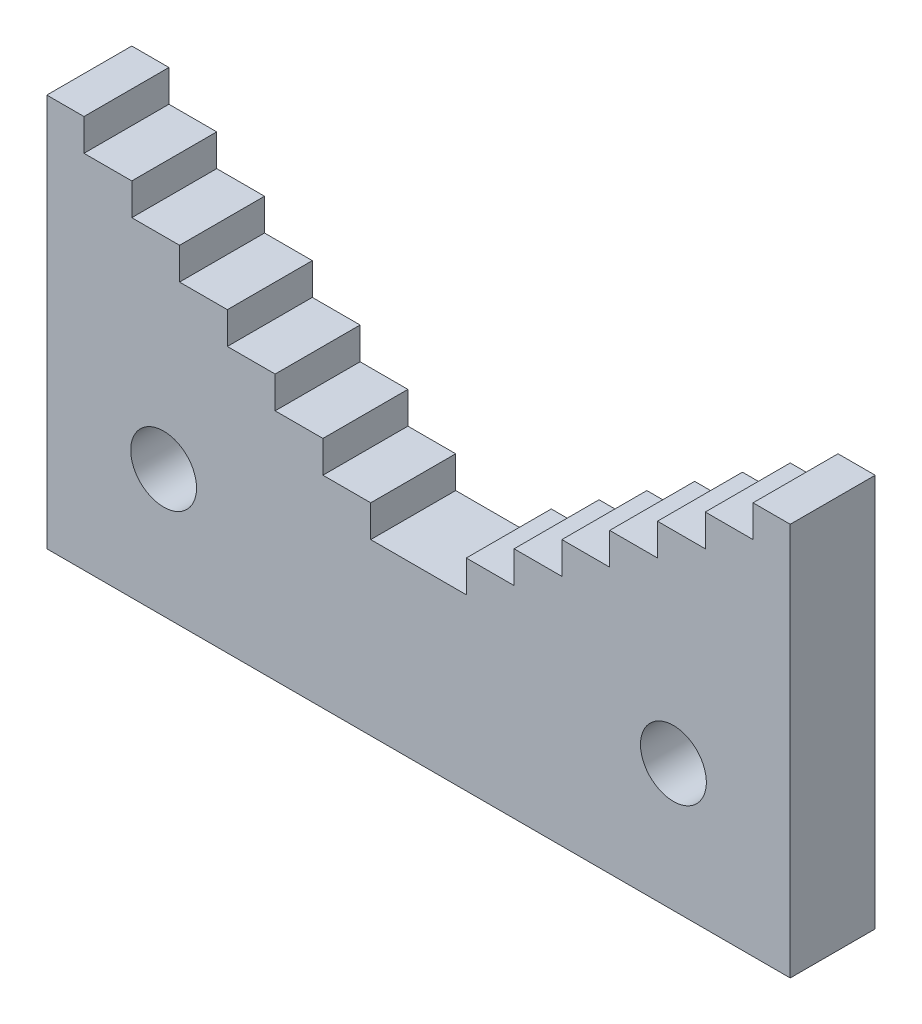
ISO-10303-21;
HEADER;
FILE_DESCRIPTION(('STEP AP214'),'2;1');
FILE_NAME('part.step','',(''),(''),'','','');
FILE_SCHEMA(('AUTOMOTIVE_DESIGN { 1 0 10303 214 1 1 1 1 }'));
ENDSEC;
DATA;
#1=APPLICATION_CONTEXT('core data for automotive mechanical design processes');
#2=APPLICATION_PROTOCOL_DEFINITION('international standard','automotive_design',2000,#1);
#3=PRODUCT_CONTEXT('',#1,'mechanical');
#4=PRODUCT('Part','Part','',(#3));
#5=PRODUCT_RELATED_PRODUCT_CATEGORY('part','',(#4));
#6=PRODUCT_DEFINITION_FORMATION('','',#4);
#7=PRODUCT_DEFINITION_CONTEXT('part definition',#1,'design');
#8=PRODUCT_DEFINITION('design','',#6,#7);
#9=PRODUCT_DEFINITION_SHAPE('','',#8);
#10=(LENGTH_UNIT() NAMED_UNIT(*) SI_UNIT(.MILLI.,.METRE.));
#11=(NAMED_UNIT(*) PLANE_ANGLE_UNIT() SI_UNIT($,.RADIAN.));
#12=(NAMED_UNIT(*) SI_UNIT($,.STERADIAN.) SOLID_ANGLE_UNIT());
#13=UNCERTAINTY_MEASURE_WITH_UNIT(LENGTH_MEASURE(1.E-05),#10,'distance_accuracy_value','');
#14=(GEOMETRIC_REPRESENTATION_CONTEXT(3) GLOBAL_UNCERTAINTY_ASSIGNED_CONTEXT((#13)) GLOBAL_UNIT_ASSIGNED_CONTEXT((#10,
#11,#12)) REPRESENTATION_CONTEXT('',''));
#15=CARTESIAN_POINT('',(0.,0.,0.));
#16=DIRECTION('',(0.,0.,1.));
#17=DIRECTION('',(1.,0.,0.));
#18=AXIS2_PLACEMENT_3D('',#15,#16,#17);
#19=CARTESIAN_POINT('',(0.,0.,8.));
#20=DIRECTION('',(0.,0.,-1.));
#21=DIRECTION('',(-1.,0.,0.));
#22=AXIS2_PLACEMENT_3D('',#19,#20,#21);
#23=PLANE('',#22);
#24=DIRECTION('',(-1.,0.,0.));
#25=VECTOR('',#24,1.);
#26=CARTESIAN_POINT('',(-35.,37.,8.));
#27=LINE('',#26,#25);
#28=CARTESIAN_POINT('',(-31.5,37.,8.));
#29=VERTEX_POINT('',#28);
#30=CARTESIAN_POINT('',(-35.,37.,8.));
#31=VERTEX_POINT('',#30);
#32=EDGE_CURVE('E247',#29,#31,#27,.T.);
#33=ORIENTED_EDGE('',*,*,#32,.T.);
#34=DIRECTION('',(0.,-1.,0.));
#35=VECTOR('',#34,1.);
#36=CARTESIAN_POINT('',(-35.,0.,8.));
#37=LINE('',#36,#35);
#38=CARTESIAN_POINT('',(-35.,0.,8.));
#39=VERTEX_POINT('',#38);
#40=EDGE_CURVE('E128',#31,#39,#37,.T.);
#41=ORIENTED_EDGE('',*,*,#40,.T.);
#42=DIRECTION('',(1.,0.,0.));
#43=VECTOR('',#42,1.);
#44=CARTESIAN_POINT('',(0.,0.,8.));
#45=LINE('',#44,#43);
#46=CARTESIAN_POINT('',(35.,0.,8.));
#47=VERTEX_POINT('',#46);
#48=EDGE_CURVE('E303',#39,#47,#45,.T.);
#49=ORIENTED_EDGE('',*,*,#48,.T.);
#50=DIRECTION('',(0.,-1.,0.));
#51=VECTOR('',#50,1.);
#52=CARTESIAN_POINT('',(35.,0.,8.));
#53=LINE('',#52,#51);
#54=CARTESIAN_POINT('',(35.,37.,8.));
#55=VERTEX_POINT('',#54);
#56=EDGE_CURVE('E337',#55,#47,#53,.T.);
#57=ORIENTED_EDGE('',*,*,#56,.F.);
#58=DIRECTION('',(1.,0.,0.));
#59=VECTOR('',#58,1.);
#60=CARTESIAN_POINT('',(35.,37.,8.));
#61=LINE('',#60,#59);
#62=CARTESIAN_POINT('',(31.5,37.,8.));
#63=VERTEX_POINT('',#62);
#64=EDGE_CURVE('E319',#63,#55,#61,.T.);
#65=ORIENTED_EDGE('',*,*,#64,.F.);
#66=DIRECTION('',(0.,1.,0.));
#67=VECTOR('',#66,1.);
#68=CARTESIAN_POINT('',(31.5,37.,8.));
#69=LINE('',#68,#67);
#70=CARTESIAN_POINT('',(31.5,34.,8.));
#71=VERTEX_POINT('',#70);
#72=EDGE_CURVE('E325',#71,#63,#69,.T.);
#73=ORIENTED_EDGE('',*,*,#72,.F.);
#74=DIRECTION('',(1.,0.,0.));
#75=VECTOR('',#74,1.);
#76=CARTESIAN_POINT('',(31.5,34.,8.));
#77=LINE('',#76,#75);
#78=CARTESIAN_POINT('',(27.,34.,8.));
#79=VERTEX_POINT('',#78);
#80=EDGE_CURVE('E486',#79,#71,#77,.T.);
#81=ORIENTED_EDGE('',*,*,#80,.F.);
#82=DIRECTION('',(0.,1.,0.));
#83=VECTOR('',#82,1.);
#84=CARTESIAN_POINT('',(27.,34.,8.));
#85=LINE('',#84,#83);
#86=CARTESIAN_POINT('',(27.,31.,8.));
#87=VERTEX_POINT('',#86);
#88=EDGE_CURVE('E482',#87,#79,#85,.T.);
#89=ORIENTED_EDGE('',*,*,#88,.F.);
#90=DIRECTION('',(1.,0.,0.));
#91=VECTOR('',#90,1.);
#92=CARTESIAN_POINT('',(27.,31.,8.));
#93=LINE('',#92,#91);
#94=CARTESIAN_POINT('',(22.5,31.,8.));
#95=VERTEX_POINT('',#94);
#96=EDGE_CURVE('E478',#95,#87,#93,.T.);
#97=ORIENTED_EDGE('',*,*,#96,.F.);
#98=DIRECTION('',(0.,1.,0.));
#99=VECTOR('',#98,1.);
#100=CARTESIAN_POINT('',(22.5,31.,8.));
#101=LINE('',#100,#99);
#102=CARTESIAN_POINT('',(22.5,28.,8.));
#103=VERTEX_POINT('',#102);
#104=EDGE_CURVE('E474',#103,#95,#101,.T.);
#105=ORIENTED_EDGE('',*,*,#104,.F.);
#106=DIRECTION('',(1.,0.,0.));
#107=VECTOR('',#106,1.);
#108=CARTESIAN_POINT('',(22.5,28.,8.));
#109=LINE('',#108,#107);
#110=CARTESIAN_POINT('',(18.,28.,8.));
#111=VERTEX_POINT('',#110);
#112=EDGE_CURVE('E470',#111,#103,#109,.T.);
#113=ORIENTED_EDGE('',*,*,#112,.F.);
#114=DIRECTION('',(0.,1.,0.));
#115=VECTOR('',#114,1.);
#116=CARTESIAN_POINT('',(18.,28.,8.));
#117=LINE('',#116,#115);
#118=CARTESIAN_POINT('',(18.,25.,8.));
#119=VERTEX_POINT('',#118);
#120=EDGE_CURVE('E466',#119,#111,#117,.T.);
#121=ORIENTED_EDGE('',*,*,#120,.F.);
#122=DIRECTION('',(1.,0.,0.));
#123=VECTOR('',#122,1.);
#124=CARTESIAN_POINT('',(18.,25.,8.));
#125=LINE('',#124,#123);
#126=CARTESIAN_POINT('',(13.5,25.,8.));
#127=VERTEX_POINT('',#126);
#128=EDGE_CURVE('E462',#127,#119,#125,.T.);
#129=ORIENTED_EDGE('',*,*,#128,.F.);
#130=DIRECTION('',(0.,1.,0.));
#131=VECTOR('',#130,1.);
#132=CARTESIAN_POINT('',(13.5,25.,8.));
#133=LINE('',#132,#131);
#134=CARTESIAN_POINT('',(13.5,22.,8.));
#135=VERTEX_POINT('',#134);
#136=EDGE_CURVE('E458',#135,#127,#133,.T.);
#137=ORIENTED_EDGE('',*,*,#136,.F.);
#138=DIRECTION('',(1.,0.,0.));
#139=VECTOR('',#138,1.);
#140=CARTESIAN_POINT('',(13.5,22.,8.));
#141=LINE('',#140,#139);
#142=CARTESIAN_POINT('',(9.00000000000001,22.,8.));
#143=VERTEX_POINT('',#142);
#144=EDGE_CURVE('E454',#143,#135,#141,.T.);
#145=ORIENTED_EDGE('',*,*,#144,.F.);
#146=DIRECTION('',(0.,1.,0.));
#147=VECTOR('',#146,1.);
#148=CARTESIAN_POINT('',(9.00000000000001,22.,8.));
#149=LINE('',#148,#147);
#150=CARTESIAN_POINT('',(9.00000000000001,19.,8.));
#151=VERTEX_POINT('',#150);
#152=EDGE_CURVE('E450',#151,#143,#149,.T.);
#153=ORIENTED_EDGE('',*,*,#152,.F.);
#154=DIRECTION('',(1.,0.,0.));
#155=VECTOR('',#154,1.);
#156=CARTESIAN_POINT('',(9.00000000000001,19.,8.));
#157=LINE('',#156,#155);
#158=CARTESIAN_POINT('',(4.5,19.,8.));
#159=VERTEX_POINT('',#158);
#160=EDGE_CURVE('E446',#159,#151,#157,.T.);
#161=ORIENTED_EDGE('',*,*,#160,.F.);
#162=DIRECTION('',(0.,1.,0.));
#163=VECTOR('',#162,1.);
#164=CARTESIAN_POINT('',(4.5,19.,8.));
#165=LINE('',#164,#163);
#166=CARTESIAN_POINT('',(4.5,16.,8.));
#167=VERTEX_POINT('',#166);
#168=EDGE_CURVE('E442',#167,#159,#165,.T.);
#169=ORIENTED_EDGE('',*,*,#168,.F.);
#170=DIRECTION('',(-1.,0.,0.));
#171=VECTOR('',#170,1.);
#172=CARTESIAN_POINT('',(-4.5,16.,8.));
#173=LINE('',#172,#171);
#174=CARTESIAN_POINT('',(-4.5,16.,8.));
#175=VERTEX_POINT('',#174);
#176=EDGE_CURVE('E409',#167,#175,#173,.T.);
#177=ORIENTED_EDGE('',*,*,#176,.T.);
#178=DIRECTION('',(0.,1.,0.));
#179=VECTOR('',#178,1.);
#180=CARTESIAN_POINT('',(-4.5,19.,8.));
#181=LINE('',#180,#179);
#182=CARTESIAN_POINT('',(-4.5,19.,8.));
#183=VERTEX_POINT('',#182);
#184=EDGE_CURVE('E412',#175,#183,#181,.T.);
#185=ORIENTED_EDGE('',*,*,#184,.T.);
#186=DIRECTION('',(-1.,0.,0.));
#187=VECTOR('',#186,1.);
#188=CARTESIAN_POINT('',(-9.00000000000001,19.,8.));
#189=LINE('',#188,#187);
#190=CARTESIAN_POINT('',(-9.00000000000001,19.,8.));
#191=VERTEX_POINT('',#190);
#192=EDGE_CURVE('E415',#183,#191,#189,.T.);
#193=ORIENTED_EDGE('',*,*,#192,.T.);
#194=DIRECTION('',(0.,1.,0.));
#195=VECTOR('',#194,1.);
#196=CARTESIAN_POINT('',(-9.00000000000001,22.,8.));
#197=LINE('',#196,#195);
#198=CARTESIAN_POINT('',(-9.00000000000001,22.,8.));
#199=VERTEX_POINT('',#198);
#200=EDGE_CURVE('E418',#191,#199,#197,.T.);
#201=ORIENTED_EDGE('',*,*,#200,.T.);
#202=DIRECTION('',(-1.,0.,0.));
#203=VECTOR('',#202,1.);
#204=CARTESIAN_POINT('',(-13.5,22.,8.));
#205=LINE('',#204,#203);
#206=CARTESIAN_POINT('',(-13.5,22.,8.));
#207=VERTEX_POINT('',#206);
#208=EDGE_CURVE('E421',#199,#207,#205,.T.);
#209=ORIENTED_EDGE('',*,*,#208,.T.);
#210=DIRECTION('',(0.,1.,0.));
#211=VECTOR('',#210,1.);
#212=CARTESIAN_POINT('',(-13.5,25.,8.));
#213=LINE('',#212,#211);
#214=CARTESIAN_POINT('',(-13.5,25.,8.));
#215=VERTEX_POINT('',#214);
#216=EDGE_CURVE('E424',#207,#215,#213,.T.);
#217=ORIENTED_EDGE('',*,*,#216,.T.);
#218=DIRECTION('',(-1.,0.,0.));
#219=VECTOR('',#218,1.);
#220=CARTESIAN_POINT('',(-18.,25.,8.));
#221=LINE('',#220,#219);
#222=CARTESIAN_POINT('',(-18.,25.,8.));
#223=VERTEX_POINT('',#222);
#224=EDGE_CURVE('E427',#215,#223,#221,.T.);
#225=ORIENTED_EDGE('',*,*,#224,.T.);
#226=DIRECTION('',(0.,1.,0.));
#227=VECTOR('',#226,1.);
#228=CARTESIAN_POINT('',(-18.,28.,8.));
#229=LINE('',#228,#227);
#230=CARTESIAN_POINT('',(-18.,28.,8.));
#231=VERTEX_POINT('',#230);
#232=EDGE_CURVE('E430',#223,#231,#229,.T.);
#233=ORIENTED_EDGE('',*,*,#232,.T.);
#234=DIRECTION('',(-1.,0.,0.));
#235=VECTOR('',#234,1.);
#236=CARTESIAN_POINT('',(-22.5,28.,8.));
#237=LINE('',#236,#235);
#238=CARTESIAN_POINT('',(-22.5,28.,8.));
#239=VERTEX_POINT('',#238);
#240=EDGE_CURVE('E433',#231,#239,#237,.T.);
#241=ORIENTED_EDGE('',*,*,#240,.T.);
#242=DIRECTION('',(0.,1.,0.));
#243=VECTOR('',#242,1.);
#244=CARTESIAN_POINT('',(-22.5,31.,8.));
#245=LINE('',#244,#243);
#246=CARTESIAN_POINT('',(-22.5,31.,8.));
#247=VERTEX_POINT('',#246);
#248=EDGE_CURVE('E436',#239,#247,#245,.T.);
#249=ORIENTED_EDGE('',*,*,#248,.T.);
#250=DIRECTION('',(-1.,0.,0.));
#251=VECTOR('',#250,1.);
#252=CARTESIAN_POINT('',(-27.,31.,8.));
#253=LINE('',#252,#251);
#254=CARTESIAN_POINT('',(-27.,31.,8.));
#255=VERTEX_POINT('',#254);
#256=EDGE_CURVE('E174',#247,#255,#253,.T.);
#257=ORIENTED_EDGE('',*,*,#256,.T.);
#258=DIRECTION('',(0.,1.,0.));
#259=VECTOR('',#258,1.);
#260=CARTESIAN_POINT('',(-27.,34.,8.));
#261=LINE('',#260,#259);
#262=CARTESIAN_POINT('',(-27.,34.,8.));
#263=VERTEX_POINT('',#262);
#264=EDGE_CURVE('E168',#255,#263,#261,.T.);
#265=ORIENTED_EDGE('',*,*,#264,.T.);
#266=DIRECTION('',(-1.,0.,0.));
#267=VECTOR('',#266,1.);
#268=CARTESIAN_POINT('',(-31.5,34.,8.));
#269=LINE('',#268,#267);
#270=CARTESIAN_POINT('',(-31.5,34.,8.));
#271=VERTEX_POINT('',#270);
#272=EDGE_CURVE('E172',#263,#271,#269,.T.);
#273=ORIENTED_EDGE('',*,*,#272,.T.);
#274=DIRECTION('',(0.,1.,0.));
#275=VECTOR('',#274,1.);
#276=CARTESIAN_POINT('',(-31.5,37.,8.));
#277=LINE('',#276,#275);
#278=EDGE_CURVE('E60',#271,#29,#277,.T.);
#279=ORIENTED_EDGE('',*,*,#278,.T.);
#280=EDGE_LOOP('',(#33,#41,#49,#57,#65,#73,#81,#89,#97,#105,#113,#121,#129,#137,#145,#153,#161,
#169,#177,#185,#193,#201,#209,#217,#225,#233,#241,#249,#257,#265,#273,#279));
#281=FACE_BOUND('',#280,.T.);
#282=CARTESIAN_POINT('',(-24.,12.,8.));
#283=DIRECTION('',(0.,0.,1.));
#284=DIRECTION('',(1.,0.,0.));
#285=AXIS2_PLACEMENT_3D('',#282,#283,#284);
#286=CIRCLE('',#285,3.1);
#287=CARTESIAN_POINT('',(-20.9,12.,8.));
#288=VERTEX_POINT('',#287);
#289=EDGE_CURVE('E201',#288,#288,#286,.T.);
#290=ORIENTED_EDGE('',*,*,#289,.F.);
#291=EDGE_LOOP('',(#290));
#292=FACE_BOUND('',#291,.T.);
#293=CARTESIAN_POINT('',(24.,12.,8.));
#294=DIRECTION('',(0.,0.,-1.));
#295=DIRECTION('',(-1.,0.,0.));
#296=AXIS2_PLACEMENT_3D('',#293,#294,#295);
#297=CIRCLE('',#296,3.1);
#298=CARTESIAN_POINT('',(20.9,12.,8.));
#299=VERTEX_POINT('',#298);
#300=EDGE_CURVE('E502',#299,#299,#297,.T.);
#301=ORIENTED_EDGE('',*,*,#300,.T.);
#302=EDGE_LOOP('',(#301));
#303=FACE_BOUND('',#302,.T.);
#304=ADVANCED_FACE('F42',(#281,#292,#303),#23,.F.);
#305=CARTESIAN_POINT('',(0.,0.,0.));
#306=DIRECTION('',(0.,0.,-1.));
#307=DIRECTION('',(-1.,0.,0.));
#308=AXIS2_PLACEMENT_3D('',#305,#306,#307);
#309=PLANE('',#308);
#310=DIRECTION('',(-1.,0.,0.));
#311=VECTOR('',#310,1.);
#312=CARTESIAN_POINT('',(-35.,37.,0.));
#313=LINE('',#312,#311);
#314=CARTESIAN_POINT('',(-31.5,37.,0.));
#315=VERTEX_POINT('',#314);
#316=CARTESIAN_POINT('',(-35.,37.,0.));
#317=VERTEX_POINT('',#316);
#318=EDGE_CURVE('E196',#315,#317,#313,.T.);
#319=ORIENTED_EDGE('',*,*,#318,.F.);
#320=DIRECTION('',(0.,1.,0.));
#321=VECTOR('',#320,1.);
#322=CARTESIAN_POINT('',(-31.5,37.,0.));
#323=LINE('',#322,#321);
#324=CARTESIAN_POINT('',(-31.5,34.,0.));
#325=VERTEX_POINT('',#324);
#326=EDGE_CURVE('E120',#325,#315,#323,.T.);
#327=ORIENTED_EDGE('',*,*,#326,.F.);
#328=DIRECTION('',(-1.,0.,0.));
#329=VECTOR('',#328,1.);
#330=CARTESIAN_POINT('',(-31.5,34.,0.));
#331=LINE('',#330,#329);
#332=CARTESIAN_POINT('',(-27.,34.,0.));
#333=VERTEX_POINT('',#332);
#334=EDGE_CURVE('E114',#333,#325,#331,.T.);
#335=ORIENTED_EDGE('',*,*,#334,.F.);
#336=DIRECTION('',(0.,1.,0.));
#337=VECTOR('',#336,1.);
#338=CARTESIAN_POINT('',(-27.,34.,0.));
#339=LINE('',#338,#337);
#340=CARTESIAN_POINT('',(-27.,31.,0.));
#341=VERTEX_POINT('',#340);
#342=EDGE_CURVE('E183',#341,#333,#339,.T.);
#343=ORIENTED_EDGE('',*,*,#342,.F.);
#344=DIRECTION('',(-1.,0.,0.));
#345=VECTOR('',#344,1.);
#346=CARTESIAN_POINT('',(-27.,31.,0.));
#347=LINE('',#346,#345);
#348=CARTESIAN_POINT('',(-22.5,31.,0.));
#349=VERTEX_POINT('',#348);
#350=EDGE_CURVE('E238',#349,#341,#347,.T.);
#351=ORIENTED_EDGE('',*,*,#350,.F.);
#352=DIRECTION('',(0.,1.,0.));
#353=VECTOR('',#352,1.);
#354=CARTESIAN_POINT('',(-22.5,31.,0.));
#355=LINE('',#354,#353);
#356=CARTESIAN_POINT('',(-22.5,28.,0.));
#357=VERTEX_POINT('',#356);
#358=EDGE_CURVE('E235',#357,#349,#355,.T.);
#359=ORIENTED_EDGE('',*,*,#358,.F.);
#360=DIRECTION('',(-1.,0.,0.));
#361=VECTOR('',#360,1.);
#362=CARTESIAN_POINT('',(-22.5,28.,0.));
#363=LINE('',#362,#361);
#364=CARTESIAN_POINT('',(-18.,28.,0.));
#365=VERTEX_POINT('',#364);
#366=EDGE_CURVE('E232',#365,#357,#363,.T.);
#367=ORIENTED_EDGE('',*,*,#366,.F.);
#368=DIRECTION('',(0.,1.,0.));
#369=VECTOR('',#368,1.);
#370=CARTESIAN_POINT('',(-18.,28.,0.));
#371=LINE('',#370,#369);
#372=CARTESIAN_POINT('',(-18.,25.,0.));
#373=VERTEX_POINT('',#372);
#374=EDGE_CURVE('E229',#373,#365,#371,.T.);
#375=ORIENTED_EDGE('',*,*,#374,.F.);
#376=DIRECTION('',(-1.,0.,0.));
#377=VECTOR('',#376,1.);
#378=CARTESIAN_POINT('',(-18.,25.,0.));
#379=LINE('',#378,#377);
#380=CARTESIAN_POINT('',(-13.5,25.,0.));
#381=VERTEX_POINT('',#380);
#382=EDGE_CURVE('E226',#381,#373,#379,.T.);
#383=ORIENTED_EDGE('',*,*,#382,.F.);
#384=DIRECTION('',(0.,1.,0.));
#385=VECTOR('',#384,1.);
#386=CARTESIAN_POINT('',(-13.5,25.,0.));
#387=LINE('',#386,#385);
#388=CARTESIAN_POINT('',(-13.5,22.,0.));
#389=VERTEX_POINT('',#388);
#390=EDGE_CURVE('E223',#389,#381,#387,.T.);
#391=ORIENTED_EDGE('',*,*,#390,.F.);
#392=DIRECTION('',(-1.,0.,0.));
#393=VECTOR('',#392,1.);
#394=CARTESIAN_POINT('',(-13.5,22.,0.));
#395=LINE('',#394,#393);
#396=CARTESIAN_POINT('',(-9.00000000000001,22.,0.));
#397=VERTEX_POINT('',#396);
#398=EDGE_CURVE('E220',#397,#389,#395,.T.);
#399=ORIENTED_EDGE('',*,*,#398,.F.);
#400=DIRECTION('',(0.,1.,0.));
#401=VECTOR('',#400,1.);
#402=CARTESIAN_POINT('',(-9.00000000000001,22.,0.));
#403=LINE('',#402,#401);
#404=CARTESIAN_POINT('',(-9.00000000000001,19.,0.));
#405=VERTEX_POINT('',#404);
#406=EDGE_CURVE('E217',#405,#397,#403,.T.);
#407=ORIENTED_EDGE('',*,*,#406,.F.);
#408=DIRECTION('',(-1.,0.,0.));
#409=VECTOR('',#408,1.);
#410=CARTESIAN_POINT('',(-9.00000000000001,19.,0.));
#411=LINE('',#410,#409);
#412=CARTESIAN_POINT('',(-4.5,19.,0.));
#413=VERTEX_POINT('',#412);
#414=EDGE_CURVE('E214',#413,#405,#411,.T.);
#415=ORIENTED_EDGE('',*,*,#414,.F.);
#416=DIRECTION('',(0.,1.,0.));
#417=VECTOR('',#416,1.);
#418=CARTESIAN_POINT('',(-4.5,19.,0.));
#419=LINE('',#418,#417);
#420=CARTESIAN_POINT('',(-4.5,16.,0.));
#421=VERTEX_POINT('',#420);
#422=EDGE_CURVE('E211',#421,#413,#419,.T.);
#423=ORIENTED_EDGE('',*,*,#422,.F.);
#424=DIRECTION('',(-1.,0.,0.));
#425=VECTOR('',#424,1.);
#426=CARTESIAN_POINT('',(-4.5,16.,0.));
#427=LINE('',#426,#425);
#428=CARTESIAN_POINT('',(4.5,16.,0.));
#429=VERTEX_POINT('',#428);
#430=EDGE_CURVE('E208',#429,#421,#427,.T.);
#431=ORIENTED_EDGE('',*,*,#430,.F.);
#432=DIRECTION('',(0.,1.,0.));
#433=VECTOR('',#432,1.);
#434=CARTESIAN_POINT('',(4.5,19.,0.));
#435=LINE('',#434,#433);
#436=CARTESIAN_POINT('',(4.5,19.,0.));
#437=VERTEX_POINT('',#436);
#438=EDGE_CURVE('E320',#429,#437,#435,.T.);
#439=ORIENTED_EDGE('',*,*,#438,.T.);
#440=DIRECTION('',(1.,0.,0.));
#441=VECTOR('',#440,1.);
#442=CARTESIAN_POINT('',(9.00000000000001,19.,0.));
#443=LINE('',#442,#441);
#444=CARTESIAN_POINT('',(9.00000000000001,19.,0.));
#445=VERTEX_POINT('',#444);
#446=EDGE_CURVE('E328',#437,#445,#443,.T.);
#447=ORIENTED_EDGE('',*,*,#446,.T.);
#448=DIRECTION('',(0.,1.,0.));
#449=VECTOR('',#448,1.);
#450=CARTESIAN_POINT('',(9.00000000000001,22.,0.));
#451=LINE('',#450,#449);
#452=CARTESIAN_POINT('',(9.00000000000001,22.,0.));
#453=VERTEX_POINT('',#452);
#454=EDGE_CURVE('E541',#445,#453,#451,.T.);
#455=ORIENTED_EDGE('',*,*,#454,.T.);
#456=DIRECTION('',(1.,0.,0.));
#457=VECTOR('',#456,1.);
#458=CARTESIAN_POINT('',(13.5,22.,0.));
#459=LINE('',#458,#457);
#460=CARTESIAN_POINT('',(13.5,22.,0.));
#461=VERTEX_POINT('',#460);
#462=EDGE_CURVE('E537',#453,#461,#459,.T.);
#463=ORIENTED_EDGE('',*,*,#462,.T.);
#464=DIRECTION('',(0.,1.,0.));
#465=VECTOR('',#464,1.);
#466=CARTESIAN_POINT('',(13.5,25.,0.));
#467=LINE('',#466,#465);
#468=CARTESIAN_POINT('',(13.5,25.,0.));
#469=VERTEX_POINT('',#468);
#470=EDGE_CURVE('E533',#461,#469,#467,.T.);
#471=ORIENTED_EDGE('',*,*,#470,.T.);
#472=DIRECTION('',(1.,0.,0.));
#473=VECTOR('',#472,1.);
#474=CARTESIAN_POINT('',(18.,25.,0.));
#475=LINE('',#474,#473);
#476=CARTESIAN_POINT('',(18.,25.,0.));
#477=VERTEX_POINT('',#476);
#478=EDGE_CURVE('E529',#469,#477,#475,.T.);
#479=ORIENTED_EDGE('',*,*,#478,.T.);
#480=DIRECTION('',(0.,1.,0.));
#481=VECTOR('',#480,1.);
#482=CARTESIAN_POINT('',(18.,28.,0.));
#483=LINE('',#482,#481);
#484=CARTESIAN_POINT('',(18.,28.,0.));
#485=VERTEX_POINT('',#484);
#486=EDGE_CURVE('E525',#477,#485,#483,.T.);
#487=ORIENTED_EDGE('',*,*,#486,.T.);
#488=DIRECTION('',(1.,0.,0.));
#489=VECTOR('',#488,1.);
#490=CARTESIAN_POINT('',(22.5,28.,0.));
#491=LINE('',#490,#489);
#492=CARTESIAN_POINT('',(22.5,28.,0.));
#493=VERTEX_POINT('',#492);
#494=EDGE_CURVE('E521',#485,#493,#491,.T.);
#495=ORIENTED_EDGE('',*,*,#494,.T.);
#496=DIRECTION('',(0.,1.,0.));
#497=VECTOR('',#496,1.);
#498=CARTESIAN_POINT('',(22.5,31.,0.));
#499=LINE('',#498,#497);
#500=CARTESIAN_POINT('',(22.5,31.,0.));
#501=VERTEX_POINT('',#500);
#502=EDGE_CURVE('E517',#493,#501,#499,.T.);
#503=ORIENTED_EDGE('',*,*,#502,.T.);
#504=DIRECTION('',(1.,0.,0.));
#505=VECTOR('',#504,1.);
#506=CARTESIAN_POINT('',(27.,31.,0.));
#507=LINE('',#506,#505);
#508=CARTESIAN_POINT('',(27.,31.,0.));
#509=VERTEX_POINT('',#508);
#510=EDGE_CURVE('E513',#501,#509,#507,.T.);
#511=ORIENTED_EDGE('',*,*,#510,.T.);
#512=DIRECTION('',(0.,1.,0.));
#513=VECTOR('',#512,1.);
#514=CARTESIAN_POINT('',(27.,34.,0.));
#515=LINE('',#514,#513);
#516=CARTESIAN_POINT('',(27.,34.,0.));
#517=VERTEX_POINT('',#516);
#518=EDGE_CURVE('E509',#509,#517,#515,.T.);
#519=ORIENTED_EDGE('',*,*,#518,.T.);
#520=DIRECTION('',(1.,0.,0.));
#521=VECTOR('',#520,1.);
#522=CARTESIAN_POINT('',(31.5,34.,0.));
#523=LINE('',#522,#521);
#524=CARTESIAN_POINT('',(31.5,34.,0.));
#525=VERTEX_POINT('',#524);
#526=EDGE_CURVE('E505',#517,#525,#523,.T.);
#527=ORIENTED_EDGE('',*,*,#526,.T.);
#528=DIRECTION('',(0.,1.,0.));
#529=VECTOR('',#528,1.);
#530=CARTESIAN_POINT('',(31.5,37.,0.));
#531=LINE('',#530,#529);
#532=CARTESIAN_POINT('',(31.5,37.,0.));
#533=VERTEX_POINT('',#532);
#534=EDGE_CURVE('E501',#525,#533,#531,.T.);
#535=ORIENTED_EDGE('',*,*,#534,.T.);
#536=DIRECTION('',(1.,0.,0.));
#537=VECTOR('',#536,1.);
#538=CARTESIAN_POINT('',(35.,37.,0.));
#539=LINE('',#538,#537);
#540=CARTESIAN_POINT('',(35.,37.,0.));
#541=VERTEX_POINT('',#540);
#542=EDGE_CURVE('E314',#533,#541,#539,.T.);
#543=ORIENTED_EDGE('',*,*,#542,.T.);
#544=DIRECTION('',(0.,-1.,0.));
#545=VECTOR('',#544,1.);
#546=CARTESIAN_POINT('',(35.,0.,0.));
#547=LINE('',#546,#545);
#548=CARTESIAN_POINT('',(35.,0.,0.));
#549=VERTEX_POINT('',#548);
#550=EDGE_CURVE('E311',#541,#549,#547,.T.);
#551=ORIENTED_EDGE('',*,*,#550,.T.);
#552=DIRECTION('',(1.,0.,0.));
#553=VECTOR('',#552,1.);
#554=CARTESIAN_POINT('',(0.,0.,0.));
#555=LINE('',#554,#553);
#556=CARTESIAN_POINT('',(-35.,0.,0.));
#557=VERTEX_POINT('',#556);
#558=EDGE_CURVE('E204',#557,#549,#555,.T.);
#559=ORIENTED_EDGE('',*,*,#558,.F.);
#560=DIRECTION('',(0.,-1.,0.));
#561=VECTOR('',#560,1.);
#562=CARTESIAN_POINT('',(-35.,0.,0.));
#563=LINE('',#562,#561);
#564=EDGE_CURVE('E200',#317,#557,#563,.T.);
#565=ORIENTED_EDGE('',*,*,#564,.F.);
#566=EDGE_LOOP('',(#319,#327,#335,#343,#351,#359,#367,#375,#383,#391,#399,#407,#415,#423,#431,
#439,#447,#455,#463,#471,#479,#487,#495,#503,#511,#519,#527,#535,#543,#551,#559,#565));
#567=FACE_BOUND('',#566,.T.);
#568=CARTESIAN_POINT('',(-24.,12.,0.));
#569=DIRECTION('',(0.,0.,1.));
#570=DIRECTION('',(1.,0.,0.));
#571=AXIS2_PLACEMENT_3D('',#568,#569,#570);
#572=CIRCLE('',#571,3.1);
#573=CARTESIAN_POINT('',(-20.9,12.,0.));
#574=VERTEX_POINT('',#573);
#575=EDGE_CURVE('E396',#574,#574,#572,.T.);
#576=ORIENTED_EDGE('',*,*,#575,.T.);
#577=EDGE_LOOP('',(#576));
#578=FACE_BOUND('',#577,.T.);
#579=CARTESIAN_POINT('',(24.,12.,0.));
#580=DIRECTION('',(0.,0.,-1.));
#581=DIRECTION('',(-1.,0.,0.));
#582=AXIS2_PLACEMENT_3D('',#579,#580,#581);
#583=CIRCLE('',#582,3.1);
#584=CARTESIAN_POINT('',(20.9,12.,0.));
#585=VERTEX_POINT('',#584);
#586=EDGE_CURVE('E783',#585,#585,#583,.T.);
#587=ORIENTED_EDGE('',*,*,#586,.F.);
#588=EDGE_LOOP('',(#587));
#589=FACE_BOUND('',#588,.T.);
#590=ADVANCED_FACE('F307',(#567,#578,#589),#309,.T.);
#591=CARTESIAN_POINT('',(-35.,37.,8.));
#592=DIRECTION('',(0.,-1.,0.));
#593=DIRECTION('',(0.,0.,-1.));
#594=AXIS2_PLACEMENT_3D('',#591,#592,#593);
#595=PLANE('',#594);
#596=ORIENTED_EDGE('',*,*,#318,.T.);
#597=DIRECTION('',(0.,0.,-1.));
#598=VECTOR('',#597,1.);
#599=CARTESIAN_POINT('',(-35.,37.,8.));
#600=LINE('',#599,#598);
#601=EDGE_CURVE('E11',#31,#317,#600,.T.);
#602=ORIENTED_EDGE('',*,*,#601,.F.);
#603=ORIENTED_EDGE('',*,*,#32,.F.);
#604=DIRECTION('',(0.,0.,-1.));
#605=VECTOR('',#604,1.);
#606=CARTESIAN_POINT('',(-31.5,37.,8.));
#607=LINE('',#606,#605);
#608=EDGE_CURVE('E192',#29,#315,#607,.T.);
#609=ORIENTED_EDGE('',*,*,#608,.T.);
#610=EDGE_LOOP('',(#596,#602,#603,#609));
#611=FACE_BOUND('',#610,.T.);
#612=ADVANCED_FACE('F44',(#611),#595,.F.);
#613=CARTESIAN_POINT('',(-35.,0.,8.));
#614=DIRECTION('',(1.,0.,0.));
#615=DIRECTION('',(0.,1.,0.));
#616=AXIS2_PLACEMENT_3D('',#613,#614,#615);
#617=PLANE('',#616);
#618=ORIENTED_EDGE('',*,*,#564,.T.);
#619=DIRECTION('',(0.,0.,-1.));
#620=VECTOR('',#619,1.);
#621=CARTESIAN_POINT('',(-35.,0.,8.));
#622=LINE('',#621,#620);
#623=EDGE_CURVE('E52',#39,#557,#622,.T.);
#624=ORIENTED_EDGE('',*,*,#623,.F.);
#625=ORIENTED_EDGE('',*,*,#40,.F.);
#626=ORIENTED_EDGE('',*,*,#601,.T.);
#627=EDGE_LOOP('',(#618,#624,#625,#626));
#628=FACE_BOUND('',#627,.T.);
#629=ADVANCED_FACE('F632',(#628),#617,.F.);
#630=CARTESIAN_POINT('',(0.,0.,8.));
#631=DIRECTION('',(0.,1.,0.));
#632=DIRECTION('',(0.,0.,1.));
#633=AXIS2_PLACEMENT_3D('',#630,#631,#632);
#634=PLANE('',#633);
#635=ORIENTED_EDGE('',*,*,#558,.T.);
#636=DIRECTION('',(0.,0.,-1.));
#637=VECTOR('',#636,1.);
#638=CARTESIAN_POINT('',(35.,0.,8.));
#639=LINE('',#638,#637);
#640=EDGE_CURVE('E336',#47,#549,#639,.T.);
#641=ORIENTED_EDGE('',*,*,#640,.F.);
#642=ORIENTED_EDGE('',*,*,#48,.F.);
#643=ORIENTED_EDGE('',*,*,#623,.T.);
#644=EDGE_LOOP('',(#635,#641,#642,#643));
#645=FACE_BOUND('',#644,.T.);
#646=ADVANCED_FACE('F298',(#645),#634,.F.);
#647=CARTESIAN_POINT('',(-4.5,16.,8.));
#648=DIRECTION('',(0.,-1.,0.));
#649=DIRECTION('',(0.,0.,-1.));
#650=AXIS2_PLACEMENT_3D('',#647,#648,#649);
#651=PLANE('',#650);
#652=ORIENTED_EDGE('',*,*,#430,.T.);
#653=DIRECTION('',(0.,0.,-1.));
#654=VECTOR('',#653,1.);
#655=CARTESIAN_POINT('',(-4.5,16.,8.));
#656=LINE('',#655,#654);
#657=EDGE_CURVE('E290',#175,#421,#656,.T.);
#658=ORIENTED_EDGE('',*,*,#657,.F.);
#659=ORIENTED_EDGE('',*,*,#176,.F.);
#660=DIRECTION('',(0.,0.,-1.));
#661=VECTOR('',#660,1.);
#662=CARTESIAN_POINT('',(4.5,16.,8.));
#663=LINE('',#662,#661);
#664=EDGE_CURVE('E340',#167,#429,#663,.T.);
#665=ORIENTED_EDGE('',*,*,#664,.T.);
#666=EDGE_LOOP('',(#652,#658,#659,#665));
#667=FACE_BOUND('',#666,.T.);
#668=ADVANCED_FACE('F638',(#667),#651,.F.);
#669=CARTESIAN_POINT('',(-4.5,19.,8.));
#670=DIRECTION('',(-1.,0.,0.));
#671=DIRECTION('',(0.,-1.,0.));
#672=AXIS2_PLACEMENT_3D('',#669,#670,#671);
#673=PLANE('',#672);
#674=ORIENTED_EDGE('',*,*,#422,.T.);
#675=DIRECTION('',(0.,0.,-1.));
#676=VECTOR('',#675,1.);
#677=CARTESIAN_POINT('',(-4.5,19.,8.));
#678=LINE('',#677,#676);
#679=EDGE_CURVE('E286',#183,#413,#678,.T.);
#680=ORIENTED_EDGE('',*,*,#679,.F.);
#681=ORIENTED_EDGE('',*,*,#184,.F.);
#682=ORIENTED_EDGE('',*,*,#657,.T.);
#683=EDGE_LOOP('',(#674,#680,#681,#682));
#684=FACE_BOUND('',#683,.T.);
#685=ADVANCED_FACE('F692',(#684),#673,.F.);
#686=CARTESIAN_POINT('',(-9.00000000000001,19.,8.));
#687=DIRECTION('',(0.,-1.,0.));
#688=DIRECTION('',(0.,0.,-1.));
#689=AXIS2_PLACEMENT_3D('',#686,#687,#688);
#690=PLANE('',#689);
#691=ORIENTED_EDGE('',*,*,#414,.T.);
#692=DIRECTION('',(0.,0.,-1.));
#693=VECTOR('',#692,1.);
#694=CARTESIAN_POINT('',(-9.00000000000001,19.,8.));
#695=LINE('',#694,#693);
#696=EDGE_CURVE('E282',#191,#405,#695,.T.);
#697=ORIENTED_EDGE('',*,*,#696,.F.);
#698=ORIENTED_EDGE('',*,*,#192,.F.);
#699=ORIENTED_EDGE('',*,*,#679,.T.);
#700=EDGE_LOOP('',(#691,#697,#698,#699));
#701=FACE_BOUND('',#700,.T.);
#702=ADVANCED_FACE('F688',(#701),#690,.F.);
#703=CARTESIAN_POINT('',(-9.00000000000001,22.,8.));
#704=DIRECTION('',(-1.,0.,0.));
#705=DIRECTION('',(0.,-1.,0.));
#706=AXIS2_PLACEMENT_3D('',#703,#704,#705);
#707=PLANE('',#706);
#708=ORIENTED_EDGE('',*,*,#406,.T.);
#709=DIRECTION('',(0.,0.,-1.));
#710=VECTOR('',#709,1.);
#711=CARTESIAN_POINT('',(-9.00000000000001,22.,8.));
#712=LINE('',#711,#710);
#713=EDGE_CURVE('E278',#199,#397,#712,.T.);
#714=ORIENTED_EDGE('',*,*,#713,.F.);
#715=ORIENTED_EDGE('',*,*,#200,.F.);
#716=ORIENTED_EDGE('',*,*,#696,.T.);
#717=EDGE_LOOP('',(#708,#714,#715,#716));
#718=FACE_BOUND('',#717,.T.);
#719=ADVANCED_FACE('F684',(#718),#707,.F.);
#720=CARTESIAN_POINT('',(-13.5,22.,8.));
#721=DIRECTION('',(0.,-1.,0.));
#722=DIRECTION('',(0.,0.,-1.));
#723=AXIS2_PLACEMENT_3D('',#720,#721,#722);
#724=PLANE('',#723);
#725=ORIENTED_EDGE('',*,*,#398,.T.);
#726=DIRECTION('',(0.,0.,-1.));
#727=VECTOR('',#726,1.);
#728=CARTESIAN_POINT('',(-13.5,22.,8.));
#729=LINE('',#728,#727);
#730=EDGE_CURVE('E274',#207,#389,#729,.T.);
#731=ORIENTED_EDGE('',*,*,#730,.F.);
#732=ORIENTED_EDGE('',*,*,#208,.F.);
#733=ORIENTED_EDGE('',*,*,#713,.T.);
#734=EDGE_LOOP('',(#725,#731,#732,#733));
#735=FACE_BOUND('',#734,.T.);
#736=ADVANCED_FACE('F680',(#735),#724,.F.);
#737=CARTESIAN_POINT('',(-13.5,25.,8.));
#738=DIRECTION('',(-1.,0.,0.));
#739=DIRECTION('',(0.,-1.,0.));
#740=AXIS2_PLACEMENT_3D('',#737,#738,#739);
#741=PLANE('',#740);
#742=ORIENTED_EDGE('',*,*,#390,.T.);
#743=DIRECTION('',(0.,0.,-1.));
#744=VECTOR('',#743,1.);
#745=CARTESIAN_POINT('',(-13.5,25.,8.));
#746=LINE('',#745,#744);
#747=EDGE_CURVE('E270',#215,#381,#746,.T.);
#748=ORIENTED_EDGE('',*,*,#747,.F.);
#749=ORIENTED_EDGE('',*,*,#216,.F.);
#750=ORIENTED_EDGE('',*,*,#730,.T.);
#751=EDGE_LOOP('',(#742,#748,#749,#750));
#752=FACE_BOUND('',#751,.T.);
#753=ADVANCED_FACE('F676',(#752),#741,.F.);
#754=CARTESIAN_POINT('',(-18.,25.,8.));
#755=DIRECTION('',(0.,-1.,0.));
#756=DIRECTION('',(0.,0.,-1.));
#757=AXIS2_PLACEMENT_3D('',#754,#755,#756);
#758=PLANE('',#757);
#759=ORIENTED_EDGE('',*,*,#382,.T.);
#760=DIRECTION('',(0.,0.,-1.));
#761=VECTOR('',#760,1.);
#762=CARTESIAN_POINT('',(-18.,25.,8.));
#763=LINE('',#762,#761);
#764=EDGE_CURVE('E266',#223,#373,#763,.T.);
#765=ORIENTED_EDGE('',*,*,#764,.F.);
#766=ORIENTED_EDGE('',*,*,#224,.F.);
#767=ORIENTED_EDGE('',*,*,#747,.T.);
#768=EDGE_LOOP('',(#759,#765,#766,#767));
#769=FACE_BOUND('',#768,.T.);
#770=ADVANCED_FACE('F672',(#769),#758,.F.);
#771=CARTESIAN_POINT('',(-18.,28.,8.));
#772=DIRECTION('',(-1.,0.,0.));
#773=DIRECTION('',(0.,0.,1.));
#774=AXIS2_PLACEMENT_3D('',#771,#772,#773);
#775=PLANE('',#774);
#776=ORIENTED_EDGE('',*,*,#374,.T.);
#777=DIRECTION('',(0.,0.,-1.));
#778=VECTOR('',#777,1.);
#779=CARTESIAN_POINT('',(-18.,28.,8.));
#780=LINE('',#779,#778);
#781=EDGE_CURVE('E262',#231,#365,#780,.T.);
#782=ORIENTED_EDGE('',*,*,#781,.F.);
#783=ORIENTED_EDGE('',*,*,#232,.F.);
#784=ORIENTED_EDGE('',*,*,#764,.T.);
#785=EDGE_LOOP('',(#776,#782,#783,#784));
#786=FACE_BOUND('',#785,.T.);
#787=ADVANCED_FACE('F668',(#786),#775,.F.);
#788=CARTESIAN_POINT('',(-22.5,28.,8.));
#789=DIRECTION('',(0.,-1.,0.));
#790=DIRECTION('',(0.,0.,-1.));
#791=AXIS2_PLACEMENT_3D('',#788,#789,#790);
#792=PLANE('',#791);
#793=ORIENTED_EDGE('',*,*,#366,.T.);
#794=DIRECTION('',(0.,0.,-1.));
#795=VECTOR('',#794,1.);
#796=CARTESIAN_POINT('',(-22.5,28.,8.));
#797=LINE('',#796,#795);
#798=EDGE_CURVE('E258',#239,#357,#797,.T.);
#799=ORIENTED_EDGE('',*,*,#798,.F.);
#800=ORIENTED_EDGE('',*,*,#240,.F.);
#801=ORIENTED_EDGE('',*,*,#781,.T.);
#802=EDGE_LOOP('',(#793,#799,#800,#801));
#803=FACE_BOUND('',#802,.T.);
#804=ADVANCED_FACE('F664',(#803),#792,.F.);
#805=CARTESIAN_POINT('',(-22.5,31.,8.));
#806=DIRECTION('',(-1.,0.,0.));
#807=DIRECTION('',(0.,0.,1.));
#808=AXIS2_PLACEMENT_3D('',#805,#806,#807);
#809=PLANE('',#808);
#810=ORIENTED_EDGE('',*,*,#358,.T.);
#811=DIRECTION('',(0.,0.,-1.));
#812=VECTOR('',#811,1.);
#813=CARTESIAN_POINT('',(-22.5,31.,8.));
#814=LINE('',#813,#812);
#815=EDGE_CURVE('E254',#247,#349,#814,.T.);
#816=ORIENTED_EDGE('',*,*,#815,.F.);
#817=ORIENTED_EDGE('',*,*,#248,.F.);
#818=ORIENTED_EDGE('',*,*,#798,.T.);
#819=EDGE_LOOP('',(#810,#816,#817,#818));
#820=FACE_BOUND('',#819,.T.);
#821=ADVANCED_FACE('F660',(#820),#809,.F.);
#822=CARTESIAN_POINT('',(-27.,31.,8.));
#823=DIRECTION('',(0.,-1.,0.));
#824=DIRECTION('',(0.,0.,-1.));
#825=AXIS2_PLACEMENT_3D('',#822,#823,#824);
#826=PLANE('',#825);
#827=ORIENTED_EDGE('',*,*,#350,.T.);
#828=DIRECTION('',(0.,0.,-1.));
#829=VECTOR('',#828,1.);
#830=CARTESIAN_POINT('',(-27.,31.,8.));
#831=LINE('',#830,#829);
#832=EDGE_CURVE('E185',#255,#341,#831,.T.);
#833=ORIENTED_EDGE('',*,*,#832,.F.);
#834=ORIENTED_EDGE('',*,*,#256,.F.);
#835=ORIENTED_EDGE('',*,*,#815,.T.);
#836=EDGE_LOOP('',(#827,#833,#834,#835));
#837=FACE_BOUND('',#836,.T.);
#838=ADVANCED_FACE('F657',(#837),#826,.F.);
#839=CARTESIAN_POINT('',(-27.,34.,8.));
#840=DIRECTION('',(-1.,0.,0.));
#841=DIRECTION('',(0.,0.,1.));
#842=AXIS2_PLACEMENT_3D('',#839,#840,#841);
#843=PLANE('',#842);
#844=ORIENTED_EDGE('',*,*,#342,.T.);
#845=DIRECTION('',(0.,0.,-1.));
#846=VECTOR('',#845,1.);
#847=CARTESIAN_POINT('',(-27.,34.,8.));
#848=LINE('',#847,#846);
#849=EDGE_CURVE('E180',#263,#333,#848,.T.);
#850=ORIENTED_EDGE('',*,*,#849,.F.);
#851=ORIENTED_EDGE('',*,*,#264,.F.);
#852=ORIENTED_EDGE('',*,*,#832,.T.);
#853=EDGE_LOOP('',(#844,#850,#851,#852));
#854=FACE_BOUND('',#853,.T.);
#855=ADVANCED_FACE('F181',(#854),#843,.F.);
#856=CARTESIAN_POINT('',(-31.5,34.,8.));
#857=DIRECTION('',(0.,-1.,0.));
#858=DIRECTION('',(0.,0.,-1.));
#859=AXIS2_PLACEMENT_3D('',#856,#857,#858);
#860=PLANE('',#859);
#861=ORIENTED_EDGE('',*,*,#334,.T.);
#862=DIRECTION('',(0.,0.,-1.));
#863=VECTOR('',#862,1.);
#864=CARTESIAN_POINT('',(-31.5,34.,8.));
#865=LINE('',#864,#863);
#866=EDGE_CURVE('E186',#271,#325,#865,.T.);
#867=ORIENTED_EDGE('',*,*,#866,.F.);
#868=ORIENTED_EDGE('',*,*,#272,.F.);
#869=ORIENTED_EDGE('',*,*,#849,.T.);
#870=EDGE_LOOP('',(#861,#867,#868,#869));
#871=FACE_BOUND('',#870,.T.);
#872=ADVANCED_FACE('F188',(#871),#860,.F.);
#873=CARTESIAN_POINT('',(-31.5,37.,8.));
#874=DIRECTION('',(-1.,0.,0.));
#875=DIRECTION('',(0.,0.,1.));
#876=AXIS2_PLACEMENT_3D('',#873,#874,#875);
#877=PLANE('',#876);
#878=ORIENTED_EDGE('',*,*,#326,.T.);
#879=ORIENTED_EDGE('',*,*,#608,.F.);
#880=ORIENTED_EDGE('',*,*,#278,.F.);
#881=ORIENTED_EDGE('',*,*,#866,.T.);
#882=EDGE_LOOP('',(#878,#879,#880,#881));
#883=FACE_BOUND('',#882,.T.);
#884=ADVANCED_FACE('F650',(#883),#877,.F.);
#885=CARTESIAN_POINT('',(-24.,12.,8.));
#886=DIRECTION('',(0.,0.,-1.));
#887=DIRECTION('',(-1.,0.,0.));
#888=AXIS2_PLACEMENT_3D('',#885,#886,#887);
#889=CYLINDRICAL_SURFACE('',#888,3.1);
#890=ORIENTED_EDGE('',*,*,#289,.T.);
#891=EDGE_LOOP('',(#890));
#892=FACE_BOUND('',#891,.T.);
#893=ORIENTED_EDGE('',*,*,#575,.F.);
#894=EDGE_LOOP('',(#893));
#895=FACE_BOUND('',#894,.T.);
#896=ADVANCED_FACE('F647',(#892,#895),#889,.F.);
#897=CARTESIAN_POINT('',(35.,37.,8.));
#898=DIRECTION('',(0.,1.,0.));
#899=DIRECTION('',(0.,0.,1.));
#900=AXIS2_PLACEMENT_3D('',#897,#898,#899);
#901=PLANE('',#900);
#902=ORIENTED_EDGE('',*,*,#542,.F.);
#903=DIRECTION('',(0.,0.,-1.));
#904=VECTOR('',#903,1.);
#905=CARTESIAN_POINT('',(31.5,37.,8.));
#906=LINE('',#905,#904);
#907=EDGE_CURVE('E392',#63,#533,#906,.T.);
#908=ORIENTED_EDGE('',*,*,#907,.F.);
#909=ORIENTED_EDGE('',*,*,#64,.T.);
#910=DIRECTION('',(0.,0.,-1.));
#911=VECTOR('',#910,1.);
#912=CARTESIAN_POINT('',(35.,37.,8.));
#913=LINE('',#912,#911);
#914=EDGE_CURVE('E332',#55,#541,#913,.T.);
#915=ORIENTED_EDGE('',*,*,#914,.T.);
#916=EDGE_LOOP('',(#902,#908,#909,#915));
#917=FACE_BOUND('',#916,.T.);
#918=ADVANCED_FACE('F626',(#917),#901,.T.);
#919=CARTESIAN_POINT('',(31.5,37.,8.));
#920=DIRECTION('',(-1.,0.,0.));
#921=DIRECTION('',(0.,0.,1.));
#922=AXIS2_PLACEMENT_3D('',#919,#920,#921);
#923=PLANE('',#922);
#924=ORIENTED_EDGE('',*,*,#534,.F.);
#925=DIRECTION('',(0.,0.,-1.));
#926=VECTOR('',#925,1.);
#927=CARTESIAN_POINT('',(31.5,34.,8.));
#928=LINE('',#927,#926);
#929=EDGE_CURVE('E388',#71,#525,#928,.T.);
#930=ORIENTED_EDGE('',*,*,#929,.F.);
#931=ORIENTED_EDGE('',*,*,#72,.T.);
#932=ORIENTED_EDGE('',*,*,#907,.T.);
#933=EDGE_LOOP('',(#924,#930,#931,#932));
#934=FACE_BOUND('',#933,.T.);
#935=ADVANCED_FACE('F767',(#934),#923,.T.);
#936=CARTESIAN_POINT('',(31.5,34.,8.));
#937=DIRECTION('',(0.,1.,0.));
#938=DIRECTION('',(0.,0.,1.));
#939=AXIS2_PLACEMENT_3D('',#936,#937,#938);
#940=PLANE('',#939);
#941=ORIENTED_EDGE('',*,*,#526,.F.);
#942=DIRECTION('',(0.,0.,-1.));
#943=VECTOR('',#942,1.);
#944=CARTESIAN_POINT('',(27.,34.,8.));
#945=LINE('',#944,#943);
#946=EDGE_CURVE('E384',#79,#517,#945,.T.);
#947=ORIENTED_EDGE('',*,*,#946,.F.);
#948=ORIENTED_EDGE('',*,*,#80,.T.);
#949=ORIENTED_EDGE('',*,*,#929,.T.);
#950=EDGE_LOOP('',(#941,#947,#948,#949));
#951=FACE_BOUND('',#950,.T.);
#952=ADVANCED_FACE('F763',(#951),#940,.T.);
#953=CARTESIAN_POINT('',(27.,34.,8.));
#954=DIRECTION('',(-1.,0.,0.));
#955=DIRECTION('',(0.,0.,1.));
#956=AXIS2_PLACEMENT_3D('',#953,#954,#955);
#957=PLANE('',#956);
#958=ORIENTED_EDGE('',*,*,#518,.F.);
#959=DIRECTION('',(0.,0.,-1.));
#960=VECTOR('',#959,1.);
#961=CARTESIAN_POINT('',(27.,31.,8.));
#962=LINE('',#961,#960);
#963=EDGE_CURVE('E380',#87,#509,#962,.T.);
#964=ORIENTED_EDGE('',*,*,#963,.F.);
#965=ORIENTED_EDGE('',*,*,#88,.T.);
#966=ORIENTED_EDGE('',*,*,#946,.T.);
#967=EDGE_LOOP('',(#958,#964,#965,#966));
#968=FACE_BOUND('',#967,.T.);
#969=ADVANCED_FACE('F759',(#968),#957,.T.);
#970=CARTESIAN_POINT('',(27.,31.,8.));
#971=DIRECTION('',(0.,1.,0.));
#972=DIRECTION('',(0.,0.,1.));
#973=AXIS2_PLACEMENT_3D('',#970,#971,#972);
#974=PLANE('',#973);
#975=ORIENTED_EDGE('',*,*,#510,.F.);
#976=DIRECTION('',(0.,0.,-1.));
#977=VECTOR('',#976,1.);
#978=CARTESIAN_POINT('',(22.5,31.,8.));
#979=LINE('',#978,#977);
#980=EDGE_CURVE('E376',#95,#501,#979,.T.);
#981=ORIENTED_EDGE('',*,*,#980,.F.);
#982=ORIENTED_EDGE('',*,*,#96,.T.);
#983=ORIENTED_EDGE('',*,*,#963,.T.);
#984=EDGE_LOOP('',(#975,#981,#982,#983));
#985=FACE_BOUND('',#984,.T.);
#986=ADVANCED_FACE('F755',(#985),#974,.T.);
#987=CARTESIAN_POINT('',(22.5,31.,8.));
#988=DIRECTION('',(-1.,0.,0.));
#989=DIRECTION('',(0.,0.,1.));
#990=AXIS2_PLACEMENT_3D('',#987,#988,#989);
#991=PLANE('',#990);
#992=ORIENTED_EDGE('',*,*,#502,.F.);
#993=DIRECTION('',(0.,0.,-1.));
#994=VECTOR('',#993,1.);
#995=CARTESIAN_POINT('',(22.5,28.,8.));
#996=LINE('',#995,#994);
#997=EDGE_CURVE('E372',#103,#493,#996,.T.);
#998=ORIENTED_EDGE('',*,*,#997,.F.);
#999=ORIENTED_EDGE('',*,*,#104,.T.);
#1000=ORIENTED_EDGE('',*,*,#980,.T.);
#1001=EDGE_LOOP('',(#992,#998,#999,#1000));
#1002=FACE_BOUND('',#1001,.T.);
#1003=ADVANCED_FACE('F751',(#1002),#991,.T.);
#1004=CARTESIAN_POINT('',(22.5,28.,8.));
#1005=DIRECTION('',(0.,1.,0.));
#1006=DIRECTION('',(0.,0.,1.));
#1007=AXIS2_PLACEMENT_3D('',#1004,#1005,#1006);
#1008=PLANE('',#1007);
#1009=ORIENTED_EDGE('',*,*,#494,.F.);
#1010=DIRECTION('',(0.,0.,-1.));
#1011=VECTOR('',#1010,1.);
#1012=CARTESIAN_POINT('',(18.,28.,8.));
#1013=LINE('',#1012,#1011);
#1014=EDGE_CURVE('E368',#111,#485,#1013,.T.);
#1015=ORIENTED_EDGE('',*,*,#1014,.F.);
#1016=ORIENTED_EDGE('',*,*,#112,.T.);
#1017=ORIENTED_EDGE('',*,*,#997,.T.);
#1018=EDGE_LOOP('',(#1009,#1015,#1016,#1017));
#1019=FACE_BOUND('',#1018,.T.);
#1020=ADVANCED_FACE('F747',(#1019),#1008,.T.);
#1021=CARTESIAN_POINT('',(18.,28.,8.));
#1022=DIRECTION('',(-1.,0.,0.));
#1023=DIRECTION('',(0.,0.,1.));
#1024=AXIS2_PLACEMENT_3D('',#1021,#1022,#1023);
#1025=PLANE('',#1024);
#1026=ORIENTED_EDGE('',*,*,#486,.F.);
#1027=DIRECTION('',(0.,0.,-1.));
#1028=VECTOR('',#1027,1.);
#1029=CARTESIAN_POINT('',(18.,25.,8.));
#1030=LINE('',#1029,#1028);
#1031=EDGE_CURVE('E364',#119,#477,#1030,.T.);
#1032=ORIENTED_EDGE('',*,*,#1031,.F.);
#1033=ORIENTED_EDGE('',*,*,#120,.T.);
#1034=ORIENTED_EDGE('',*,*,#1014,.T.);
#1035=EDGE_LOOP('',(#1026,#1032,#1033,#1034));
#1036=FACE_BOUND('',#1035,.T.);
#1037=ADVANCED_FACE('F743',(#1036),#1025,.T.);
#1038=CARTESIAN_POINT('',(18.,25.,8.));
#1039=DIRECTION('',(0.,1.,0.));
#1040=DIRECTION('',(0.,0.,1.));
#1041=AXIS2_PLACEMENT_3D('',#1038,#1039,#1040);
#1042=PLANE('',#1041);
#1043=ORIENTED_EDGE('',*,*,#478,.F.);
#1044=DIRECTION('',(0.,0.,-1.));
#1045=VECTOR('',#1044,1.);
#1046=CARTESIAN_POINT('',(13.5,25.,8.));
#1047=LINE('',#1046,#1045);
#1048=EDGE_CURVE('E360',#127,#469,#1047,.T.);
#1049=ORIENTED_EDGE('',*,*,#1048,.F.);
#1050=ORIENTED_EDGE('',*,*,#128,.T.);
#1051=ORIENTED_EDGE('',*,*,#1031,.T.);
#1052=EDGE_LOOP('',(#1043,#1049,#1050,#1051));
#1053=FACE_BOUND('',#1052,.T.);
#1054=ADVANCED_FACE('F739',(#1053),#1042,.T.);
#1055=CARTESIAN_POINT('',(13.5,25.,8.));
#1056=DIRECTION('',(-1.,0.,0.));
#1057=DIRECTION('',(0.,-1.,0.));
#1058=AXIS2_PLACEMENT_3D('',#1055,#1056,#1057);
#1059=PLANE('',#1058);
#1060=ORIENTED_EDGE('',*,*,#470,.F.);
#1061=DIRECTION('',(0.,0.,-1.));
#1062=VECTOR('',#1061,1.);
#1063=CARTESIAN_POINT('',(13.5,22.,8.));
#1064=LINE('',#1063,#1062);
#1065=EDGE_CURVE('E356',#135,#461,#1064,.T.);
#1066=ORIENTED_EDGE('',*,*,#1065,.F.);
#1067=ORIENTED_EDGE('',*,*,#136,.T.);
#1068=ORIENTED_EDGE('',*,*,#1048,.T.);
#1069=EDGE_LOOP('',(#1060,#1066,#1067,#1068));
#1070=FACE_BOUND('',#1069,.T.);
#1071=ADVANCED_FACE('F735',(#1070),#1059,.T.);
#1072=CARTESIAN_POINT('',(13.5,22.,8.));
#1073=DIRECTION('',(0.,1.,0.));
#1074=DIRECTION('',(0.,0.,1.));
#1075=AXIS2_PLACEMENT_3D('',#1072,#1073,#1074);
#1076=PLANE('',#1075);
#1077=ORIENTED_EDGE('',*,*,#462,.F.);
#1078=DIRECTION('',(0.,0.,-1.));
#1079=VECTOR('',#1078,1.);
#1080=CARTESIAN_POINT('',(9.00000000000001,22.,8.));
#1081=LINE('',#1080,#1079);
#1082=EDGE_CURVE('E352',#143,#453,#1081,.T.);
#1083=ORIENTED_EDGE('',*,*,#1082,.F.);
#1084=ORIENTED_EDGE('',*,*,#144,.T.);
#1085=ORIENTED_EDGE('',*,*,#1065,.T.);
#1086=EDGE_LOOP('',(#1077,#1083,#1084,#1085));
#1087=FACE_BOUND('',#1086,.T.);
#1088=ADVANCED_FACE('F731',(#1087),#1076,.T.);
#1089=CARTESIAN_POINT('',(9.00000000000001,22.,8.));
#1090=DIRECTION('',(-1.,0.,0.));
#1091=DIRECTION('',(0.,-1.,0.));
#1092=AXIS2_PLACEMENT_3D('',#1089,#1090,#1091);
#1093=PLANE('',#1092);
#1094=ORIENTED_EDGE('',*,*,#454,.F.);
#1095=DIRECTION('',(0.,0.,-1.));
#1096=VECTOR('',#1095,1.);
#1097=CARTESIAN_POINT('',(9.00000000000001,19.,8.));
#1098=LINE('',#1097,#1096);
#1099=EDGE_CURVE('E348',#151,#445,#1098,.T.);
#1100=ORIENTED_EDGE('',*,*,#1099,.F.);
#1101=ORIENTED_EDGE('',*,*,#152,.T.);
#1102=ORIENTED_EDGE('',*,*,#1082,.T.);
#1103=EDGE_LOOP('',(#1094,#1100,#1101,#1102));
#1104=FACE_BOUND('',#1103,.T.);
#1105=ADVANCED_FACE('F725',(#1104),#1093,.T.);
#1106=CARTESIAN_POINT('',(9.00000000000001,19.,8.));
#1107=DIRECTION('',(0.,1.,0.));
#1108=DIRECTION('',(0.,0.,1.));
#1109=AXIS2_PLACEMENT_3D('',#1106,#1107,#1108);
#1110=PLANE('',#1109);
#1111=ORIENTED_EDGE('',*,*,#446,.F.);
#1112=DIRECTION('',(0.,0.,-1.));
#1113=VECTOR('',#1112,1.);
#1114=CARTESIAN_POINT('',(4.5,19.,8.));
#1115=LINE('',#1114,#1113);
#1116=EDGE_CURVE('E344',#159,#437,#1115,.T.);
#1117=ORIENTED_EDGE('',*,*,#1116,.F.);
#1118=ORIENTED_EDGE('',*,*,#160,.T.);
#1119=ORIENTED_EDGE('',*,*,#1099,.T.);
#1120=EDGE_LOOP('',(#1111,#1117,#1118,#1119));
#1121=FACE_BOUND('',#1120,.T.);
#1122=ADVANCED_FACE('F556',(#1121),#1110,.T.);
#1123=CARTESIAN_POINT('',(4.5,19.,8.));
#1124=DIRECTION('',(-1.,0.,0.));
#1125=DIRECTION('',(0.,-1.,0.));
#1126=AXIS2_PLACEMENT_3D('',#1123,#1124,#1125);
#1127=PLANE('',#1126);
#1128=ORIENTED_EDGE('',*,*,#438,.F.);
#1129=ORIENTED_EDGE('',*,*,#664,.F.);
#1130=ORIENTED_EDGE('',*,*,#168,.T.);
#1131=ORIENTED_EDGE('',*,*,#1116,.T.);
#1132=EDGE_LOOP('',(#1128,#1129,#1130,#1131));
#1133=FACE_BOUND('',#1132,.T.);
#1134=ADVANCED_FACE('F716',(#1133),#1127,.T.);
#1135=CARTESIAN_POINT('',(35.,0.,8.));
#1136=DIRECTION('',(1.,0.,0.));
#1137=DIRECTION('',(0.,1.,0.));
#1138=AXIS2_PLACEMENT_3D('',#1135,#1136,#1137);
#1139=PLANE('',#1138);
#1140=ORIENTED_EDGE('',*,*,#550,.F.);
#1141=ORIENTED_EDGE('',*,*,#914,.F.);
#1142=ORIENTED_EDGE('',*,*,#56,.T.);
#1143=ORIENTED_EDGE('',*,*,#640,.T.);
#1144=EDGE_LOOP('',(#1140,#1141,#1142,#1143));
#1145=FACE_BOUND('',#1144,.T.);
#1146=ADVANCED_FACE('F628',(#1145),#1139,.T.);
#1147=CARTESIAN_POINT('',(24.,12.,8.));
#1148=DIRECTION('',(0.,0.,-1.));
#1149=DIRECTION('',(-1.,0.,0.));
#1150=AXIS2_PLACEMENT_3D('',#1147,#1148,#1149);
#1151=CYLINDRICAL_SURFACE('',#1150,3.1);
#1152=ORIENTED_EDGE('',*,*,#300,.F.);
#1153=EDGE_LOOP('',(#1152));
#1154=FACE_BOUND('',#1153,.T.);
#1155=ORIENTED_EDGE('',*,*,#586,.T.);
#1156=EDGE_LOOP('',(#1155));
#1157=FACE_BOUND('',#1156,.T.);
#1158=ADVANCED_FACE('F723',(#1154,#1157),#1151,.F.);
#1159=CLOSED_SHELL('',(#304,#590,#612,#629,#646,#668,#685,#702,#719,#736,#753,#770,#787,#804,
#821,#838,#855,#872,#884,#896,#918,#935,#952,#969,#986,#1003,#1020,#1037,#1054,#1071,#1088,
#1105,#1122,#1134,#1146,#1158));
#1160=MANIFOLD_SOLID_BREP('B2',#1159);
#1161=ADVANCED_BREP_SHAPE_REPRESENTATION('',(#18,#1160),#14);
#1162=SHAPE_DEFINITION_REPRESENTATION(#9,#1161);
ENDSEC;
END-ISO-10303-21;
